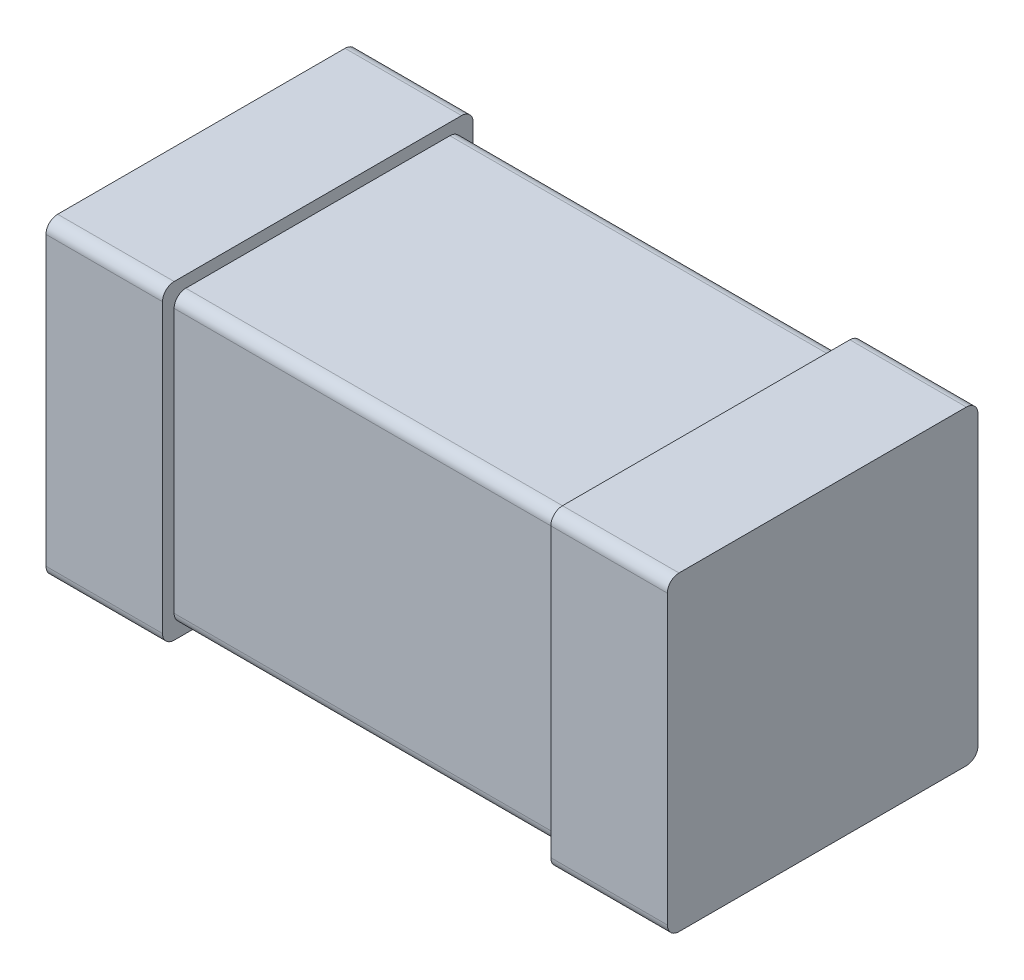
ISO-10303-21;
HEADER;
FILE_DESCRIPTION(('STEP AP214'),'2;1');
FILE_NAME('part.step','',(''),(''),'','','');
FILE_SCHEMA(('AUTOMOTIVE_DESIGN { 1 0 10303 214 1 1 1 1 }'));
ENDSEC;
DATA;
#1=APPLICATION_CONTEXT('core data for automotive mechanical design processes');
#2=APPLICATION_PROTOCOL_DEFINITION('international standard','automotive_design',2000,#1);
#3=PRODUCT_CONTEXT('',#1,'mechanical');
#4=PRODUCT('Part','Part','',(#3));
#5=PRODUCT_RELATED_PRODUCT_CATEGORY('part','',(#4));
#6=PRODUCT_DEFINITION_FORMATION('','',#4);
#7=PRODUCT_DEFINITION_CONTEXT('part definition',#1,'design');
#8=PRODUCT_DEFINITION('design','',#6,#7);
#9=PRODUCT_DEFINITION_SHAPE('','',#8);
#10=(LENGTH_UNIT() NAMED_UNIT(*) SI_UNIT(.MILLI.,.METRE.));
#11=(NAMED_UNIT(*) PLANE_ANGLE_UNIT() SI_UNIT($,.RADIAN.));
#12=(NAMED_UNIT(*) SI_UNIT($,.STERADIAN.) SOLID_ANGLE_UNIT());
#13=UNCERTAINTY_MEASURE_WITH_UNIT(LENGTH_MEASURE(1.E-05),#10,'distance_accuracy_value','');
#14=(GEOMETRIC_REPRESENTATION_CONTEXT(3) GLOBAL_UNCERTAINTY_ASSIGNED_CONTEXT((#13)) GLOBAL_UNIT_ASSIGNED_CONTEXT((#10,
#11,#12)) REPRESENTATION_CONTEXT('',''));
#15=CARTESIAN_POINT('',(0.,0.,0.));
#16=DIRECTION('',(0.,0.,1.));
#17=DIRECTION('',(1.,0.,0.));
#18=AXIS2_PLACEMENT_3D('',#15,#16,#17);
#19=CARTESIAN_POINT('',(0.8,-0.4,0.));
#20=DIRECTION('',(1.,0.,0.));
#21=DIRECTION('',(0.,0.,-1.));
#22=AXIS2_PLACEMENT_3D('',#19,#20,#21);
#23=PLANE('',#22);
#24=DIRECTION('',(0.,1.,0.));
#25=VECTOR('',#24,1.);
#26=CARTESIAN_POINT('',(0.8,-0.4,0.8));
#27=LINE('',#26,#25);
#28=CARTESIAN_POINT('',(0.8,-0.37,0.8));
#29=VERTEX_POINT('',#28);
#30=CARTESIAN_POINT('',(0.8,0.37,0.8));
#31=VERTEX_POINT('',#30);
#32=EDGE_CURVE('E219',#29,#31,#27,.T.);
#33=ORIENTED_EDGE('',*,*,#32,.F.);
#34=CARTESIAN_POINT('',(0.8,-0.37,0.77));
#35=DIRECTION('',(1.,0.,0.));
#36=DIRECTION('',(0.,0.,-1.));
#37=AXIS2_PLACEMENT_3D('',#34,#35,#36);
#38=CIRCLE('',#37,0.03);
#39=CARTESIAN_POINT('',(0.8,-0.4,0.77));
#40=VERTEX_POINT('',#39);
#41=EDGE_CURVE('E291',#40,#29,#38,.F.);
#42=ORIENTED_EDGE('',*,*,#41,.F.);
#43=DIRECTION('',(0.,0.,1.));
#44=VECTOR('',#43,1.);
#45=CARTESIAN_POINT('',(0.8,-0.4,0.));
#46=LINE('',#45,#44);
#47=CARTESIAN_POINT('',(0.8,-0.4,0.03));
#48=VERTEX_POINT('',#47);
#49=EDGE_CURVE('E181',#40,#48,#46,.F.);
#50=ORIENTED_EDGE('',*,*,#49,.T.);
#51=CARTESIAN_POINT('',(0.8,-0.37,0.03));
#52=DIRECTION('',(1.,0.,0.));
#53=DIRECTION('',(0.,0.,-1.));
#54=AXIS2_PLACEMENT_3D('',#51,#52,#53);
#55=CIRCLE('',#54,0.03);
#56=CARTESIAN_POINT('',(0.8,-0.37,0.));
#57=VERTEX_POINT('',#56);
#58=EDGE_CURVE('E20',#57,#48,#55,.F.);
#59=ORIENTED_EDGE('',*,*,#58,.F.);
#60=DIRECTION('',(0.,1.,0.));
#61=VECTOR('',#60,1.);
#62=CARTESIAN_POINT('',(0.8,-0.4,0.));
#63=LINE('',#62,#61);
#64=CARTESIAN_POINT('',(0.8,0.37,0.));
#65=VERTEX_POINT('',#64);
#66=EDGE_CURVE('E178',#57,#65,#63,.T.);
#67=ORIENTED_EDGE('',*,*,#66,.T.);
#68=CARTESIAN_POINT('',(0.8,0.37,0.03));
#69=DIRECTION('',(1.,0.,0.));
#70=DIRECTION('',(0.,0.,-1.));
#71=AXIS2_PLACEMENT_3D('',#68,#69,#70);
#72=CIRCLE('',#71,0.03);
#73=CARTESIAN_POINT('',(0.8,0.4,0.03));
#74=VERTEX_POINT('',#73);
#75=EDGE_CURVE('E192',#74,#65,#72,.F.);
#76=ORIENTED_EDGE('',*,*,#75,.F.);
#77=DIRECTION('',(0.,0.,1.));
#78=VECTOR('',#77,1.);
#79=CARTESIAN_POINT('',(0.8,0.4,0.));
#80=LINE('',#79,#78);
#81=CARTESIAN_POINT('',(0.8,0.4,0.77));
#82=VERTEX_POINT('',#81);
#83=EDGE_CURVE('E223',#82,#74,#80,.F.);
#84=ORIENTED_EDGE('',*,*,#83,.F.);
#85=CARTESIAN_POINT('',(0.8,0.37,0.77));
#86=DIRECTION('',(1.,0.,0.));
#87=DIRECTION('',(0.,0.,-1.));
#88=AXIS2_PLACEMENT_3D('',#85,#86,#87);
#89=CIRCLE('',#88,0.03);
#90=EDGE_CURVE('E294',#31,#82,#89,.F.);
#91=ORIENTED_EDGE('',*,*,#90,.F.);
#92=EDGE_LOOP('',(#33,#42,#50,#59,#67,#76,#84,#91));
#93=FACE_BOUND('',#92,.T.);
#94=ADVANCED_FACE('F17',(#93),#23,.T.);
#95=CARTESIAN_POINT('',(-0.8,-0.4,0.));
#96=DIRECTION('',(1.,0.,0.));
#97=DIRECTION('',(0.,0.,-1.));
#98=AXIS2_PLACEMENT_3D('',#95,#96,#97);
#99=PLANE('',#98);
#100=CARTESIAN_POINT('',(-0.8,-0.37,0.77));
#101=DIRECTION('',(1.,0.,0.));
#102=DIRECTION('',(0.,0.,-1.));
#103=AXIS2_PLACEMENT_3D('',#100,#101,#102);
#104=CIRCLE('',#103,0.03);
#105=CARTESIAN_POINT('',(-0.8,-0.37,0.8));
#106=VERTEX_POINT('',#105);
#107=CARTESIAN_POINT('',(-0.8,-0.4,0.77));
#108=VERTEX_POINT('',#107);
#109=EDGE_CURVE('E281',#106,#108,#104,.T.);
#110=ORIENTED_EDGE('',*,*,#109,.F.);
#111=DIRECTION('',(0.,1.,0.));
#112=VECTOR('',#111,1.);
#113=CARTESIAN_POINT('',(-0.8,-0.4,0.8));
#114=LINE('',#113,#112);
#115=CARTESIAN_POINT('',(-0.8,0.37,0.8));
#116=VERTEX_POINT('',#115);
#117=EDGE_CURVE('E201',#116,#106,#114,.F.);
#118=ORIENTED_EDGE('',*,*,#117,.F.);
#119=CARTESIAN_POINT('',(-0.8,0.37,0.77));
#120=DIRECTION('',(1.,0.,0.));
#121=DIRECTION('',(0.,0.,-1.));
#122=AXIS2_PLACEMENT_3D('',#119,#120,#121);
#123=CIRCLE('',#122,0.03);
#124=CARTESIAN_POINT('',(-0.8,0.4,0.77));
#125=VERTEX_POINT('',#124);
#126=EDGE_CURVE('E210',#125,#116,#123,.T.);
#127=ORIENTED_EDGE('',*,*,#126,.F.);
#128=DIRECTION('',(0.,0.,1.));
#129=VECTOR('',#128,1.);
#130=CARTESIAN_POINT('',(-0.8,0.4,0.));
#131=LINE('',#130,#129);
#132=CARTESIAN_POINT('',(-0.8,0.4,0.03));
#133=VERTEX_POINT('',#132);
#134=EDGE_CURVE('E208',#133,#125,#131,.T.);
#135=ORIENTED_EDGE('',*,*,#134,.F.);
#136=CARTESIAN_POINT('',(-0.8,0.37,0.03));
#137=DIRECTION('',(1.,0.,0.));
#138=DIRECTION('',(0.,0.,-1.));
#139=AXIS2_PLACEMENT_3D('',#136,#137,#138);
#140=CIRCLE('',#139,0.03);
#141=CARTESIAN_POINT('',(-0.8,0.37,0.));
#142=VERTEX_POINT('',#141);
#143=EDGE_CURVE('E287',#142,#133,#140,.T.);
#144=ORIENTED_EDGE('',*,*,#143,.F.);
#145=DIRECTION('',(0.,1.,0.));
#146=VECTOR('',#145,1.);
#147=CARTESIAN_POINT('',(-0.8,-0.4,0.));
#148=LINE('',#147,#146);
#149=CARTESIAN_POINT('',(-0.8,-0.37,0.));
#150=VERTEX_POINT('',#149);
#151=EDGE_CURVE('E212',#142,#150,#148,.F.);
#152=ORIENTED_EDGE('',*,*,#151,.T.);
#153=CARTESIAN_POINT('',(-0.8,-0.37,0.03));
#154=DIRECTION('',(1.,0.,0.));
#155=DIRECTION('',(0.,0.,-1.));
#156=AXIS2_PLACEMENT_3D('',#153,#154,#155);
#157=CIRCLE('',#156,0.03);
#158=CARTESIAN_POINT('',(-0.8,-0.4,0.03));
#159=VERTEX_POINT('',#158);
#160=EDGE_CURVE('E207',#159,#150,#157,.T.);
#161=ORIENTED_EDGE('',*,*,#160,.F.);
#162=DIRECTION('',(0.,0.,1.));
#163=VECTOR('',#162,1.);
#164=CARTESIAN_POINT('',(-0.8,-0.4,0.));
#165=LINE('',#164,#163);
#166=EDGE_CURVE('E205',#159,#108,#165,.T.);
#167=ORIENTED_EDGE('',*,*,#166,.T.);
#168=EDGE_LOOP('',(#110,#118,#127,#135,#144,#152,#161,#167));
#169=FACE_BOUND('',#168,.T.);
#170=ADVANCED_FACE('F689',(#169),#99,.F.);
#171=CARTESIAN_POINT('',(0.5,-0.37,0.03));
#172=DIRECTION('',(1.,0.,0.));
#173=DIRECTION('',(0.,0.,-1.));
#174=AXIS2_PLACEMENT_3D('',#171,#172,#173);
#175=CYLINDRICAL_SURFACE('',#174,0.03);
#176=ORIENTED_EDGE('',*,*,#58,.T.);
#177=DIRECTION('',(1.,0.,0.));
#178=VECTOR('',#177,1.);
#179=CARTESIAN_POINT('',(0.5,-0.4,0.03));
#180=LINE('',#179,#178);
#181=CARTESIAN_POINT('',(0.5,-0.4,0.03));
#182=VERTEX_POINT('',#181);
#183=EDGE_CURVE('E336',#48,#182,#180,.F.);
#184=ORIENTED_EDGE('',*,*,#183,.T.);
#185=CARTESIAN_POINT('',(0.5,-0.37,0.03));
#186=DIRECTION('',(1.,0.,0.));
#187=DIRECTION('',(0.,0.,-1.));
#188=AXIS2_PLACEMENT_3D('',#185,#186,#187);
#189=CIRCLE('',#188,0.03);
#190=CARTESIAN_POINT('',(0.5,-0.37,0.));
#191=VERTEX_POINT('',#190);
#192=EDGE_CURVE('E196',#182,#191,#189,.T.);
#193=ORIENTED_EDGE('',*,*,#192,.T.);
#194=DIRECTION('',(1.,0.,0.));
#195=VECTOR('',#194,1.);
#196=CARTESIAN_POINT('',(0.5,-0.37,0.));
#197=LINE('',#196,#195);
#198=EDGE_CURVE('E186',#191,#57,#197,.T.);
#199=ORIENTED_EDGE('',*,*,#198,.T.);
#200=EDGE_LOOP('',(#176,#184,#193,#199));
#201=FACE_BOUND('',#200,.T.);
#202=ADVANCED_FACE('F195',(#201),#175,.T.);
#203=CARTESIAN_POINT('',(0.5,-0.4,0.));
#204=DIRECTION('',(0.,0.,1.));
#205=DIRECTION('',(1.,0.,0.));
#206=AXIS2_PLACEMENT_3D('',#203,#204,#205);
#207=PLANE('',#206);
#208=DIRECTION('',(1.,0.,0.));
#209=VECTOR('',#208,1.);
#210=CARTESIAN_POINT('',(0.5,0.37,0.));
#211=LINE('',#210,#209);
#212=CARTESIAN_POINT('',(0.5,0.37,0.));
#213=VERTEX_POINT('',#212);
#214=EDGE_CURVE('E191',#65,#213,#211,.F.);
#215=ORIENTED_EDGE('',*,*,#214,.F.);
#216=ORIENTED_EDGE('',*,*,#66,.F.);
#217=ORIENTED_EDGE('',*,*,#198,.F.);
#218=DIRECTION('',(0.,1.,0.));
#219=VECTOR('',#218,1.);
#220=CARTESIAN_POINT('',(0.5,-0.4,0.));
#221=LINE('',#220,#219);
#222=EDGE_CURVE('E278',#191,#213,#221,.T.);
#223=ORIENTED_EDGE('',*,*,#222,.T.);
#224=EDGE_LOOP('',(#215,#216,#217,#223));
#225=FACE_BOUND('',#224,.T.);
#226=ADVANCED_FACE('F188',(#225),#207,.F.);
#227=CARTESIAN_POINT('',(0.5,0.37,0.03));
#228=DIRECTION('',(1.,0.,0.));
#229=DIRECTION('',(0.,0.,-1.));
#230=AXIS2_PLACEMENT_3D('',#227,#228,#229);
#231=CYLINDRICAL_SURFACE('',#230,0.03);
#232=ORIENTED_EDGE('',*,*,#214,.T.);
#233=CARTESIAN_POINT('',(0.5,0.37,0.03));
#234=DIRECTION('',(1.,0.,0.));
#235=DIRECTION('',(0.,0.,-1.));
#236=AXIS2_PLACEMENT_3D('',#233,#234,#235);
#237=CIRCLE('',#236,0.03);
#238=CARTESIAN_POINT('',(0.5,0.4,0.03));
#239=VERTEX_POINT('',#238);
#240=EDGE_CURVE('E275',#213,#239,#237,.T.);
#241=ORIENTED_EDGE('',*,*,#240,.T.);
#242=DIRECTION('',(1.,0.,0.));
#243=VECTOR('',#242,1.);
#244=CARTESIAN_POINT('',(0.5,0.4,0.03));
#245=LINE('',#244,#243);
#246=EDGE_CURVE('E224',#74,#239,#245,.F.);
#247=ORIENTED_EDGE('',*,*,#246,.F.);
#248=ORIENTED_EDGE('',*,*,#75,.T.);
#249=EDGE_LOOP('',(#232,#241,#247,#248));
#250=FACE_BOUND('',#249,.T.);
#251=ADVANCED_FACE('F298',(#250),#231,.T.);
#252=CARTESIAN_POINT('',(0.5,0.4,0.));
#253=DIRECTION('',(0.,1.,0.));
#254=DIRECTION('',(0.,0.,1.));
#255=AXIS2_PLACEMENT_3D('',#252,#253,#254);
#256=PLANE('',#255);
#257=DIRECTION('',(0.,0.,-1.));
#258=VECTOR('',#257,1.);
#259=CARTESIAN_POINT('',(0.5,0.4,0.));
#260=LINE('',#259,#258);
#261=CARTESIAN_POINT('',(0.5,0.4,0.77));
#262=VERTEX_POINT('',#261);
#263=EDGE_CURVE('E274',#239,#262,#260,.F.);
#264=ORIENTED_EDGE('',*,*,#263,.T.);
#265=DIRECTION('',(1.,0.,0.));
#266=VECTOR('',#265,1.);
#267=CARTESIAN_POINT('',(0.5,0.4,0.77));
#268=LINE('',#267,#266);
#269=EDGE_CURVE('E222',#82,#262,#268,.F.);
#270=ORIENTED_EDGE('',*,*,#269,.F.);
#271=ORIENTED_EDGE('',*,*,#83,.T.);
#272=ORIENTED_EDGE('',*,*,#246,.T.);
#273=EDGE_LOOP('',(#264,#270,#271,#272));
#274=FACE_BOUND('',#273,.T.);
#275=ADVANCED_FACE('F341',(#274),#256,.T.);
#276=CARTESIAN_POINT('',(0.5,0.37,0.77));
#277=DIRECTION('',(1.,0.,0.));
#278=DIRECTION('',(0.,0.,-1.));
#279=AXIS2_PLACEMENT_3D('',#276,#277,#278);
#280=CYLINDRICAL_SURFACE('',#279,0.03);
#281=ORIENTED_EDGE('',*,*,#90,.T.);
#282=ORIENTED_EDGE('',*,*,#269,.T.);
#283=CARTESIAN_POINT('',(0.5,0.37,0.77));
#284=DIRECTION('',(1.,0.,0.));
#285=DIRECTION('',(0.,0.,-1.));
#286=AXIS2_PLACEMENT_3D('',#283,#284,#285);
#287=CIRCLE('',#286,0.03);
#288=CARTESIAN_POINT('',(0.5,0.37,0.8));
#289=VERTEX_POINT('',#288);
#290=EDGE_CURVE('E271',#262,#289,#287,.T.);
#291=ORIENTED_EDGE('',*,*,#290,.T.);
#292=DIRECTION('',(1.,0.,0.));
#293=VECTOR('',#292,1.);
#294=CARTESIAN_POINT('',(0.5,0.37,0.8));
#295=LINE('',#294,#293);
#296=EDGE_CURVE('E221',#31,#289,#295,.F.);
#297=ORIENTED_EDGE('',*,*,#296,.F.);
#298=EDGE_LOOP('',(#281,#282,#291,#297));
#299=FACE_BOUND('',#298,.T.);
#300=ADVANCED_FACE('F348',(#299),#280,.T.);
#301=CARTESIAN_POINT('',(0.5,-0.4,0.8));
#302=DIRECTION('',(0.,0.,1.));
#303=DIRECTION('',(1.,0.,0.));
#304=AXIS2_PLACEMENT_3D('',#301,#302,#303);
#305=PLANE('',#304);
#306=ORIENTED_EDGE('',*,*,#32,.T.);
#307=ORIENTED_EDGE('',*,*,#296,.T.);
#308=DIRECTION('',(0.,1.,0.));
#309=VECTOR('',#308,1.);
#310=CARTESIAN_POINT('',(0.5,-0.4,0.8));
#311=LINE('',#310,#309);
#312=CARTESIAN_POINT('',(0.5,-0.37,0.8));
#313=VERTEX_POINT('',#312);
#314=EDGE_CURVE('E270',#289,#313,#311,.F.);
#315=ORIENTED_EDGE('',*,*,#314,.T.);
#316=DIRECTION('',(1.,0.,0.));
#317=VECTOR('',#316,1.);
#318=CARTESIAN_POINT('',(0.5,-0.37,0.8));
#319=LINE('',#318,#317);
#320=EDGE_CURVE('E293',#29,#313,#319,.F.);
#321=ORIENTED_EDGE('',*,*,#320,.F.);
#322=EDGE_LOOP('',(#306,#307,#315,#321));
#323=FACE_BOUND('',#322,.T.);
#324=ADVANCED_FACE('F352',(#323),#305,.T.);
#325=CARTESIAN_POINT('',(0.5,-0.37,0.77));
#326=DIRECTION('',(1.,0.,0.));
#327=DIRECTION('',(0.,0.,-1.));
#328=AXIS2_PLACEMENT_3D('',#325,#326,#327);
#329=CYLINDRICAL_SURFACE('',#328,0.03);
#330=ORIENTED_EDGE('',*,*,#320,.T.);
#331=CARTESIAN_POINT('',(0.5,-0.37,0.77));
#332=DIRECTION('',(1.,0.,0.));
#333=DIRECTION('',(0.,0.,-1.));
#334=AXIS2_PLACEMENT_3D('',#331,#332,#333);
#335=CIRCLE('',#334,0.03);
#336=CARTESIAN_POINT('',(0.5,-0.4,0.77));
#337=VERTEX_POINT('',#336);
#338=EDGE_CURVE('E266',#313,#337,#335,.T.);
#339=ORIENTED_EDGE('',*,*,#338,.T.);
#340=DIRECTION('',(1.,0.,0.));
#341=VECTOR('',#340,1.);
#342=CARTESIAN_POINT('',(0.5,-0.4,0.77));
#343=LINE('',#342,#341);
#344=EDGE_CURVE('E218',#337,#40,#343,.T.);
#345=ORIENTED_EDGE('',*,*,#344,.T.);
#346=ORIENTED_EDGE('',*,*,#41,.T.);
#347=EDGE_LOOP('',(#330,#339,#345,#346));
#348=FACE_BOUND('',#347,.T.);
#349=ADVANCED_FACE('F630',(#348),#329,.T.);
#350=CARTESIAN_POINT('',(0.5,-0.4,0.));
#351=DIRECTION('',(0.,1.,0.));
#352=DIRECTION('',(0.,0.,1.));
#353=AXIS2_PLACEMENT_3D('',#350,#351,#352);
#354=PLANE('',#353);
#355=ORIENTED_EDGE('',*,*,#344,.F.);
#356=DIRECTION('',(0.,0.,-1.));
#357=VECTOR('',#356,1.);
#358=CARTESIAN_POINT('',(0.5,-0.4,0.));
#359=LINE('',#358,#357);
#360=EDGE_CURVE('E269',#337,#182,#359,.T.);
#361=ORIENTED_EDGE('',*,*,#360,.T.);
#362=ORIENTED_EDGE('',*,*,#183,.F.);
#363=ORIENTED_EDGE('',*,*,#49,.F.);
#364=EDGE_LOOP('',(#355,#361,#362,#363));
#365=FACE_BOUND('',#364,.T.);
#366=ADVANCED_FACE('F620',(#365),#354,.F.);
#367=CARTESIAN_POINT('',(-0.8,-0.4,0.));
#368=DIRECTION('',(0.,1.,0.));
#369=DIRECTION('',(0.,0.,1.));
#370=AXIS2_PLACEMENT_3D('',#367,#368,#369);
#371=PLANE('',#370);
#372=DIRECTION('',(1.,0.,0.));
#373=VECTOR('',#372,1.);
#374=CARTESIAN_POINT('',(-0.8,-0.4,0.77));
#375=LINE('',#374,#373);
#376=CARTESIAN_POINT('',(-0.5,-0.4,0.77));
#377=VERTEX_POINT('',#376);
#378=EDGE_CURVE('E318',#108,#377,#375,.T.);
#379=ORIENTED_EDGE('',*,*,#378,.F.);
#380=ORIENTED_EDGE('',*,*,#166,.F.);
#381=DIRECTION('',(1.,0.,0.));
#382=VECTOR('',#381,1.);
#383=CARTESIAN_POINT('',(-0.8,-0.4,0.03));
#384=LINE('',#383,#382);
#385=CARTESIAN_POINT('',(-0.5,-0.4,0.03));
#386=VERTEX_POINT('',#385);
#387=EDGE_CURVE('E290',#386,#159,#384,.F.);
#388=ORIENTED_EDGE('',*,*,#387,.F.);
#389=DIRECTION('',(0.,0.,-1.));
#390=VECTOR('',#389,1.);
#391=CARTESIAN_POINT('',(-0.5,-0.4,0.));
#392=LINE('',#391,#390);
#393=EDGE_CURVE('E250',#377,#386,#392,.T.);
#394=ORIENTED_EDGE('',*,*,#393,.F.);
#395=EDGE_LOOP('',(#379,#380,#388,#394));
#396=FACE_BOUND('',#395,.T.);
#397=ADVANCED_FACE('F610',(#396),#371,.F.);
#398=CARTESIAN_POINT('',(-0.8,-0.37,0.03));
#399=DIRECTION('',(1.,0.,0.));
#400=DIRECTION('',(0.,0.,-1.));
#401=AXIS2_PLACEMENT_3D('',#398,#399,#400);
#402=CYLINDRICAL_SURFACE('',#401,0.03);
#403=CARTESIAN_POINT('',(-0.5,-0.37,0.03));
#404=DIRECTION('',(1.,0.,0.));
#405=DIRECTION('',(0.,0.,-1.));
#406=AXIS2_PLACEMENT_3D('',#403,#404,#405);
#407=CIRCLE('',#406,0.03);
#408=CARTESIAN_POINT('',(-0.5,-0.37,0.));
#409=VERTEX_POINT('',#408);
#410=EDGE_CURVE('E248',#386,#409,#407,.T.);
#411=ORIENTED_EDGE('',*,*,#410,.F.);
#412=ORIENTED_EDGE('',*,*,#387,.T.);
#413=ORIENTED_EDGE('',*,*,#160,.T.);
#414=DIRECTION('',(1.,0.,0.));
#415=VECTOR('',#414,1.);
#416=CARTESIAN_POINT('',(-0.8,-0.37,0.));
#417=LINE('',#416,#415);
#418=EDGE_CURVE('E216',#150,#409,#417,.T.);
#419=ORIENTED_EDGE('',*,*,#418,.T.);
#420=EDGE_LOOP('',(#411,#412,#413,#419));
#421=FACE_BOUND('',#420,.T.);
#422=ADVANCED_FACE('F600',(#421),#402,.T.);
#423=CARTESIAN_POINT('',(-0.8,-0.4,0.));
#424=DIRECTION('',(0.,0.,1.));
#425=DIRECTION('',(1.,0.,0.));
#426=AXIS2_PLACEMENT_3D('',#423,#424,#425);
#427=PLANE('',#426);
#428=DIRECTION('',(1.,0.,0.));
#429=VECTOR('',#428,1.);
#430=CARTESIAN_POINT('',(-0.8,0.37,0.));
#431=LINE('',#430,#429);
#432=CARTESIAN_POINT('',(-0.5,0.37,0.));
#433=VERTEX_POINT('',#432);
#434=EDGE_CURVE('E215',#433,#142,#431,.F.);
#435=ORIENTED_EDGE('',*,*,#434,.F.);
#436=DIRECTION('',(0.,1.,0.));
#437=VECTOR('',#436,1.);
#438=CARTESIAN_POINT('',(-0.5,-0.4,0.));
#439=LINE('',#438,#437);
#440=EDGE_CURVE('E247',#409,#433,#439,.T.);
#441=ORIENTED_EDGE('',*,*,#440,.F.);
#442=ORIENTED_EDGE('',*,*,#418,.F.);
#443=ORIENTED_EDGE('',*,*,#151,.F.);
#444=EDGE_LOOP('',(#435,#441,#442,#443));
#445=FACE_BOUND('',#444,.T.);
#446=ADVANCED_FACE('F590',(#445),#427,.F.);
#447=CARTESIAN_POINT('',(-0.8,0.37,0.03));
#448=DIRECTION('',(1.,0.,0.));
#449=DIRECTION('',(0.,0.,-1.));
#450=AXIS2_PLACEMENT_3D('',#447,#448,#449);
#451=CYLINDRICAL_SURFACE('',#450,0.03);
#452=ORIENTED_EDGE('',*,*,#434,.T.);
#453=ORIENTED_EDGE('',*,*,#143,.T.);
#454=DIRECTION('',(1.,0.,0.));
#455=VECTOR('',#454,1.);
#456=CARTESIAN_POINT('',(-0.8,0.4,0.03));
#457=LINE('',#456,#455);
#458=CARTESIAN_POINT('',(-0.5,0.4,0.03));
#459=VERTEX_POINT('',#458);
#460=EDGE_CURVE('E211',#459,#133,#457,.F.);
#461=ORIENTED_EDGE('',*,*,#460,.F.);
#462=CARTESIAN_POINT('',(-0.5,0.37,0.03));
#463=DIRECTION('',(1.,0.,0.));
#464=DIRECTION('',(0.,0.,-1.));
#465=AXIS2_PLACEMENT_3D('',#462,#463,#464);
#466=CIRCLE('',#465,0.03);
#467=EDGE_CURVE('E245',#433,#459,#466,.T.);
#468=ORIENTED_EDGE('',*,*,#467,.F.);
#469=EDGE_LOOP('',(#452,#453,#461,#468));
#470=FACE_BOUND('',#469,.T.);
#471=ADVANCED_FACE('F580',(#470),#451,.T.);
#472=CARTESIAN_POINT('',(-0.8,0.4,0.));
#473=DIRECTION('',(0.,1.,0.));
#474=DIRECTION('',(0.,0.,1.));
#475=AXIS2_PLACEMENT_3D('',#472,#473,#474);
#476=PLANE('',#475);
#477=ORIENTED_EDGE('',*,*,#134,.T.);
#478=DIRECTION('',(1.,0.,0.));
#479=VECTOR('',#478,1.);
#480=CARTESIAN_POINT('',(-0.8,0.4,0.77));
#481=LINE('',#480,#479);
#482=CARTESIAN_POINT('',(-0.5,0.4,0.77));
#483=VERTEX_POINT('',#482);
#484=EDGE_CURVE('E204',#483,#125,#481,.F.);
#485=ORIENTED_EDGE('',*,*,#484,.F.);
#486=DIRECTION('',(0.,0.,-1.));
#487=VECTOR('',#486,1.);
#488=CARTESIAN_POINT('',(-0.5,0.4,0.));
#489=LINE('',#488,#487);
#490=EDGE_CURVE('E244',#459,#483,#489,.F.);
#491=ORIENTED_EDGE('',*,*,#490,.F.);
#492=ORIENTED_EDGE('',*,*,#460,.T.);
#493=EDGE_LOOP('',(#477,#485,#491,#492));
#494=FACE_BOUND('',#493,.T.);
#495=ADVANCED_FACE('F570',(#494),#476,.T.);
#496=CARTESIAN_POINT('',(-0.8,0.37,0.77));
#497=DIRECTION('',(1.,0.,0.));
#498=DIRECTION('',(0.,0.,-1.));
#499=AXIS2_PLACEMENT_3D('',#496,#497,#498);
#500=CYLINDRICAL_SURFACE('',#499,0.03);
#501=CARTESIAN_POINT('',(-0.5,0.37,0.77));
#502=DIRECTION('',(1.,0.,0.));
#503=DIRECTION('',(0.,0.,-1.));
#504=AXIS2_PLACEMENT_3D('',#501,#502,#503);
#505=CIRCLE('',#504,0.03);
#506=CARTESIAN_POINT('',(-0.5,0.37,0.8));
#507=VERTEX_POINT('',#506);
#508=EDGE_CURVE('E242',#483,#507,#505,.T.);
#509=ORIENTED_EDGE('',*,*,#508,.F.);
#510=ORIENTED_EDGE('',*,*,#484,.T.);
#511=ORIENTED_EDGE('',*,*,#126,.T.);
#512=DIRECTION('',(1.,0.,0.));
#513=VECTOR('',#512,1.);
#514=CARTESIAN_POINT('',(-0.8,0.37,0.8));
#515=LINE('',#514,#513);
#516=EDGE_CURVE('E203',#507,#116,#515,.F.);
#517=ORIENTED_EDGE('',*,*,#516,.F.);
#518=EDGE_LOOP('',(#509,#510,#511,#517));
#519=FACE_BOUND('',#518,.T.);
#520=ADVANCED_FACE('F560',(#519),#500,.T.);
#521=CARTESIAN_POINT('',(-0.8,-0.4,0.8));
#522=DIRECTION('',(0.,0.,1.));
#523=DIRECTION('',(1.,0.,0.));
#524=AXIS2_PLACEMENT_3D('',#521,#522,#523);
#525=PLANE('',#524);
#526=DIRECTION('',(0.,1.,0.));
#527=VECTOR('',#526,1.);
#528=CARTESIAN_POINT('',(-0.5,-0.4,0.8));
#529=LINE('',#528,#527);
#530=CARTESIAN_POINT('',(-0.5,-0.37,0.8));
#531=VERTEX_POINT('',#530);
#532=EDGE_CURVE('E241',#507,#531,#529,.F.);
#533=ORIENTED_EDGE('',*,*,#532,.F.);
#534=ORIENTED_EDGE('',*,*,#516,.T.);
#535=ORIENTED_EDGE('',*,*,#117,.T.);
#536=DIRECTION('',(1.,0.,0.));
#537=VECTOR('',#536,1.);
#538=CARTESIAN_POINT('',(-0.8,-0.37,0.8));
#539=LINE('',#538,#537);
#540=EDGE_CURVE('E285',#531,#106,#539,.F.);
#541=ORIENTED_EDGE('',*,*,#540,.F.);
#542=EDGE_LOOP('',(#533,#534,#535,#541));
#543=FACE_BOUND('',#542,.T.);
#544=ADVANCED_FACE('F550',(#543),#525,.T.);
#545=CARTESIAN_POINT('',(-0.8,-0.37,0.77));
#546=DIRECTION('',(1.,0.,0.));
#547=DIRECTION('',(0.,0.,-1.));
#548=AXIS2_PLACEMENT_3D('',#545,#546,#547);
#549=CYLINDRICAL_SURFACE('',#548,0.03);
#550=ORIENTED_EDGE('',*,*,#540,.T.);
#551=ORIENTED_EDGE('',*,*,#109,.T.);
#552=ORIENTED_EDGE('',*,*,#378,.T.);
#553=CARTESIAN_POINT('',(-0.5,-0.37,0.77));
#554=DIRECTION('',(1.,0.,0.));
#555=DIRECTION('',(0.,0.,-1.));
#556=AXIS2_PLACEMENT_3D('',#553,#554,#555);
#557=CIRCLE('',#556,0.03);
#558=EDGE_CURVE('E238',#531,#377,#557,.T.);
#559=ORIENTED_EDGE('',*,*,#558,.F.);
#560=EDGE_LOOP('',(#550,#551,#552,#559));
#561=FACE_BOUND('',#560,.T.);
#562=ADVANCED_FACE('F510',(#561),#549,.T.);
#563=CARTESIAN_POINT('',(-0.5,-0.37,0.03));
#564=DIRECTION('',(0.,1.,0.));
#565=DIRECTION('',(0.,0.,1.));
#566=AXIS2_PLACEMENT_3D('',#563,#564,#565);
#567=PLANE('',#566);
#568=DIRECTION('',(1.,0.,0.));
#569=VECTOR('',#568,1.);
#570=CARTESIAN_POINT('',(-0.5,-0.37,0.74));
#571=LINE('',#570,#569);
#572=CARTESIAN_POINT('',(-0.5,-0.37,0.74));
#573=VERTEX_POINT('',#572);
#574=CARTESIAN_POINT('',(0.5,-0.37,0.74));
#575=VERTEX_POINT('',#574);
#576=EDGE_CURVE('E284',#573,#575,#571,.T.);
#577=ORIENTED_EDGE('',*,*,#576,.F.);
#578=DIRECTION('',(0.,0.,-1.));
#579=VECTOR('',#578,1.);
#580=CARTESIAN_POINT('',(-0.5,-0.37,0.));
#581=LINE('',#580,#579);
#582=CARTESIAN_POINT('',(-0.5,-0.37,0.06));
#583=VERTEX_POINT('',#582);
#584=EDGE_CURVE('E234',#583,#573,#581,.F.);
#585=ORIENTED_EDGE('',*,*,#584,.F.);
#586=DIRECTION('',(1.,0.,0.));
#587=VECTOR('',#586,1.);
#588=CARTESIAN_POINT('',(-0.5,-0.37,0.06));
#589=LINE('',#588,#587);
#590=CARTESIAN_POINT('',(0.5,-0.37,0.06));
#591=VERTEX_POINT('',#590);
#592=EDGE_CURVE('E280',#591,#583,#589,.F.);
#593=ORIENTED_EDGE('',*,*,#592,.F.);
#594=DIRECTION('',(0.,0.,-1.));
#595=VECTOR('',#594,1.);
#596=CARTESIAN_POINT('',(0.5,-0.37,0.));
#597=LINE('',#596,#595);
#598=EDGE_CURVE('E265',#591,#575,#597,.F.);
#599=ORIENTED_EDGE('',*,*,#598,.T.);
#600=EDGE_LOOP('',(#577,#585,#593,#599));
#601=FACE_BOUND('',#600,.T.);
#602=ADVANCED_FACE('F401',(#601),#567,.F.);
#603=CARTESIAN_POINT('',(-0.5,-0.34,0.74));
#604=DIRECTION('',(1.,0.,0.));
#605=DIRECTION('',(0.,0.,-1.));
#606=AXIS2_PLACEMENT_3D('',#603,#604,#605);
#607=CYLINDRICAL_SURFACE('',#606,0.03);
#608=DIRECTION('',(1.,0.,0.));
#609=VECTOR('',#608,1.);
#610=CARTESIAN_POINT('',(-0.5,-0.34,0.77));
#611=LINE('',#610,#609);
#612=CARTESIAN_POINT('',(-0.5,-0.34,0.77));
#613=VERTEX_POINT('',#612);
#614=CARTESIAN_POINT('',(0.5,-0.34,0.77));
#615=VERTEX_POINT('',#614);
#616=EDGE_CURVE('E314',#613,#615,#611,.T.);
#617=ORIENTED_EDGE('',*,*,#616,.F.);
#618=CARTESIAN_POINT('',(-0.5,-0.34,0.74));
#619=DIRECTION('',(1.,0.,0.));
#620=DIRECTION('',(0.,0.,-1.));
#621=AXIS2_PLACEMENT_3D('',#618,#619,#620);
#622=CIRCLE('',#621,0.03);
#623=EDGE_CURVE('E232',#573,#613,#622,.F.);
#624=ORIENTED_EDGE('',*,*,#623,.F.);
#625=ORIENTED_EDGE('',*,*,#576,.T.);
#626=CARTESIAN_POINT('',(0.5,-0.34,0.74));
#627=DIRECTION('',(1.,0.,0.));
#628=DIRECTION('',(0.,0.,-1.));
#629=AXIS2_PLACEMENT_3D('',#626,#627,#628);
#630=CIRCLE('',#629,0.03);
#631=EDGE_CURVE('E262',#575,#615,#630,.F.);
#632=ORIENTED_EDGE('',*,*,#631,.T.);
#633=EDGE_LOOP('',(#617,#624,#625,#632));
#634=FACE_BOUND('',#633,.T.);
#635=ADVANCED_FACE('F405',(#634),#607,.T.);
#636=CARTESIAN_POINT('',(-0.5,-0.37,0.77));
#637=DIRECTION('',(0.,0.,1.));
#638=DIRECTION('',(1.,0.,0.));
#639=AXIS2_PLACEMENT_3D('',#636,#637,#638);
#640=PLANE('',#639);
#641=DIRECTION('',(0.,1.,0.));
#642=VECTOR('',#641,1.);
#643=CARTESIAN_POINT('',(0.5,-0.4,0.77));
#644=LINE('',#643,#642);
#645=CARTESIAN_POINT('',(0.5,0.34,0.77));
#646=VERTEX_POINT('',#645);
#647=EDGE_CURVE('E261',#615,#646,#644,.T.);
#648=ORIENTED_EDGE('',*,*,#647,.T.);
#649=DIRECTION('',(1.,0.,0.));
#650=VECTOR('',#649,1.);
#651=CARTESIAN_POINT('',(-0.5,0.34,0.77));
#652=LINE('',#651,#650);
#653=CARTESIAN_POINT('',(-0.5,0.34,0.77));
#654=VERTEX_POINT('',#653);
#655=EDGE_CURVE('E312',#654,#646,#652,.T.);
#656=ORIENTED_EDGE('',*,*,#655,.F.);
#657=DIRECTION('',(0.,1.,0.));
#658=VECTOR('',#657,1.);
#659=CARTESIAN_POINT('',(-0.5,-0.4,0.77));
#660=LINE('',#659,#658);
#661=EDGE_CURVE('E231',#613,#654,#660,.T.);
#662=ORIENTED_EDGE('',*,*,#661,.F.);
#663=ORIENTED_EDGE('',*,*,#616,.T.);
#664=EDGE_LOOP('',(#648,#656,#662,#663));
#665=FACE_BOUND('',#664,.T.);
#666=ADVANCED_FACE('F409',(#665),#640,.T.);
#667=CARTESIAN_POINT('',(-0.5,0.34,0.74));
#668=DIRECTION('',(1.,0.,0.));
#669=DIRECTION('',(0.,0.,-1.));
#670=AXIS2_PLACEMENT_3D('',#667,#668,#669);
#671=CYLINDRICAL_SURFACE('',#670,0.03);
#672=CARTESIAN_POINT('',(0.5,0.34,0.74));
#673=DIRECTION('',(1.,0.,0.));
#674=DIRECTION('',(0.,0.,-1.));
#675=AXIS2_PLACEMENT_3D('',#672,#673,#674);
#676=CIRCLE('',#675,0.03);
#677=CARTESIAN_POINT('',(0.5,0.37,0.74));
#678=VERTEX_POINT('',#677);
#679=EDGE_CURVE('E258',#646,#678,#676,.F.);
#680=ORIENTED_EDGE('',*,*,#679,.T.);
#681=DIRECTION('',(1.,0.,0.));
#682=VECTOR('',#681,1.);
#683=CARTESIAN_POINT('',(-0.5,0.37,0.74));
#684=LINE('',#683,#682);
#685=CARTESIAN_POINT('',(-0.5,0.37,0.74));
#686=VERTEX_POINT('',#685);
#687=EDGE_CURVE('E310',#686,#678,#684,.T.);
#688=ORIENTED_EDGE('',*,*,#687,.F.);
#689=CARTESIAN_POINT('',(-0.5,0.34,0.74));
#690=DIRECTION('',(1.,0.,0.));
#691=DIRECTION('',(0.,0.,-1.));
#692=AXIS2_PLACEMENT_3D('',#689,#690,#691);
#693=CIRCLE('',#692,0.03);
#694=EDGE_CURVE('E229',#654,#686,#693,.F.);
#695=ORIENTED_EDGE('',*,*,#694,.F.);
#696=ORIENTED_EDGE('',*,*,#655,.T.);
#697=EDGE_LOOP('',(#680,#688,#695,#696));
#698=FACE_BOUND('',#697,.T.);
#699=ADVANCED_FACE('F413',(#698),#671,.T.);
#700=CARTESIAN_POINT('',(-0.5,0.37,0.03));
#701=DIRECTION('',(0.,1.,0.));
#702=DIRECTION('',(0.,0.,1.));
#703=AXIS2_PLACEMENT_3D('',#700,#701,#702);
#704=PLANE('',#703);
#705=DIRECTION('',(0.,0.,-1.));
#706=VECTOR('',#705,1.);
#707=CARTESIAN_POINT('',(-0.5,0.37,0.));
#708=LINE('',#707,#706);
#709=CARTESIAN_POINT('',(-0.5,0.37,0.06));
#710=VERTEX_POINT('',#709);
#711=EDGE_CURVE('E228',#686,#710,#708,.T.);
#712=ORIENTED_EDGE('',*,*,#711,.F.);
#713=ORIENTED_EDGE('',*,*,#687,.T.);
#714=DIRECTION('',(0.,0.,-1.));
#715=VECTOR('',#714,1.);
#716=CARTESIAN_POINT('',(0.5,0.37,0.));
#717=LINE('',#716,#715);
#718=CARTESIAN_POINT('',(0.5,0.37,0.06));
#719=VERTEX_POINT('',#718);
#720=EDGE_CURVE('E257',#678,#719,#717,.T.);
#721=ORIENTED_EDGE('',*,*,#720,.T.);
#722=DIRECTION('',(1.,0.,0.));
#723=VECTOR('',#722,1.);
#724=CARTESIAN_POINT('',(-0.5,0.37,0.06));
#725=LINE('',#724,#723);
#726=EDGE_CURVE('E253',#710,#719,#725,.T.);
#727=ORIENTED_EDGE('',*,*,#726,.F.);
#728=EDGE_LOOP('',(#712,#713,#721,#727));
#729=FACE_BOUND('',#728,.T.);
#730=ADVANCED_FACE('F383',(#729),#704,.T.);
#731=CARTESIAN_POINT('',(-0.5,-0.34,0.06));
#732=DIRECTION('',(1.,0.,0.));
#733=DIRECTION('',(0.,0.,-1.));
#734=AXIS2_PLACEMENT_3D('',#731,#732,#733);
#735=CYLINDRICAL_SURFACE('',#734,0.03);
#736=CARTESIAN_POINT('',(0.5,-0.34,0.06));
#737=DIRECTION('',(1.,0.,0.));
#738=DIRECTION('',(0.,0.,-1.));
#739=AXIS2_PLACEMENT_3D('',#736,#737,#738);
#740=CIRCLE('',#739,0.03);
#741=CARTESIAN_POINT('',(0.5,-0.34,0.03));
#742=VERTEX_POINT('',#741);
#743=EDGE_CURVE('E254',#742,#591,#740,.F.);
#744=ORIENTED_EDGE('',*,*,#743,.T.);
#745=ORIENTED_EDGE('',*,*,#592,.T.);
#746=CARTESIAN_POINT('',(-0.5,-0.34,0.06));
#747=DIRECTION('',(1.,0.,0.));
#748=DIRECTION('',(0.,0.,-1.));
#749=AXIS2_PLACEMENT_3D('',#746,#747,#748);
#750=CIRCLE('',#749,0.03);
#751=CARTESIAN_POINT('',(-0.5,-0.34,0.03));
#752=VERTEX_POINT('',#751);
#753=EDGE_CURVE('E235',#752,#583,#750,.F.);
#754=ORIENTED_EDGE('',*,*,#753,.F.);
#755=DIRECTION('',(1.,0.,0.));
#756=VECTOR('',#755,1.);
#757=CARTESIAN_POINT('',(-0.5,-0.34,0.03));
#758=LINE('',#757,#756);
#759=EDGE_CURVE('E227',#752,#742,#758,.T.);
#760=ORIENTED_EDGE('',*,*,#759,.T.);
#761=EDGE_LOOP('',(#744,#745,#754,#760));
#762=FACE_BOUND('',#761,.T.);
#763=ADVANCED_FACE('F396',(#762),#735,.T.);
#764=CARTESIAN_POINT('',(0.5,-0.4,0.));
#765=DIRECTION('',(1.,0.,0.));
#766=DIRECTION('',(0.,0.,-1.));
#767=AXIS2_PLACEMENT_3D('',#764,#765,#766);
#768=PLANE('',#767);
#769=DIRECTION('',(0.,1.,0.));
#770=VECTOR('',#769,1.);
#771=CARTESIAN_POINT('',(0.5,-0.37,0.03));
#772=LINE('',#771,#770);
#773=CARTESIAN_POINT('',(0.5,0.34,0.03));
#774=VERTEX_POINT('',#773);
#775=EDGE_CURVE('E363',#742,#774,#772,.T.);
#776=ORIENTED_EDGE('',*,*,#775,.T.);
#777=CARTESIAN_POINT('',(0.5,0.34,0.06));
#778=DIRECTION('',(1.,0.,0.));
#779=DIRECTION('',(0.,0.,-1.));
#780=AXIS2_PLACEMENT_3D('',#777,#778,#779);
#781=CIRCLE('',#780,0.03);
#782=EDGE_CURVE('E251',#719,#774,#781,.F.);
#783=ORIENTED_EDGE('',*,*,#782,.F.);
#784=ORIENTED_EDGE('',*,*,#720,.F.);
#785=ORIENTED_EDGE('',*,*,#679,.F.);
#786=ORIENTED_EDGE('',*,*,#647,.F.);
#787=ORIENTED_EDGE('',*,*,#631,.F.);
#788=ORIENTED_EDGE('',*,*,#598,.F.);
#789=ORIENTED_EDGE('',*,*,#743,.F.);
#790=EDGE_LOOP('',(#776,#783,#784,#785,#786,#787,#788,#789));
#791=FACE_BOUND('',#790,.T.);
#792=ORIENTED_EDGE('',*,*,#338,.F.);
#793=ORIENTED_EDGE('',*,*,#314,.F.);
#794=ORIENTED_EDGE('',*,*,#290,.F.);
#795=ORIENTED_EDGE('',*,*,#263,.F.);
#796=ORIENTED_EDGE('',*,*,#240,.F.);
#797=ORIENTED_EDGE('',*,*,#222,.F.);
#798=ORIENTED_EDGE('',*,*,#192,.F.);
#799=ORIENTED_EDGE('',*,*,#360,.F.);
#800=EDGE_LOOP('',(#792,#793,#794,#795,#796,#797,#798,#799));
#801=FACE_BOUND('',#800,.T.);
#802=ADVANCED_FACE('F302',(#791,#801),#768,.F.);
#803=CARTESIAN_POINT('',(-0.5,0.34,0.06));
#804=DIRECTION('',(1.,0.,0.));
#805=DIRECTION('',(0.,0.,-1.));
#806=AXIS2_PLACEMENT_3D('',#803,#804,#805);
#807=CYLINDRICAL_SURFACE('',#806,0.03);
#808=DIRECTION('',(1.,0.,0.));
#809=VECTOR('',#808,1.);
#810=CARTESIAN_POINT('',(-0.5,0.34,0.03));
#811=LINE('',#810,#809);
#812=CARTESIAN_POINT('',(-0.5,0.34,0.03));
#813=VERTEX_POINT('',#812);
#814=EDGE_CURVE('E26',#774,#813,#811,.F.);
#815=ORIENTED_EDGE('',*,*,#814,.T.);
#816=CARTESIAN_POINT('',(-0.5,0.34,0.06));
#817=DIRECTION('',(1.,0.,0.));
#818=DIRECTION('',(0.,0.,-1.));
#819=AXIS2_PLACEMENT_3D('',#816,#817,#818);
#820=CIRCLE('',#819,0.03);
#821=EDGE_CURVE('E34',#710,#813,#820,.F.);
#822=ORIENTED_EDGE('',*,*,#821,.F.);
#823=ORIENTED_EDGE('',*,*,#726,.T.);
#824=ORIENTED_EDGE('',*,*,#782,.T.);
#825=EDGE_LOOP('',(#815,#822,#823,#824));
#826=FACE_BOUND('',#825,.T.);
#827=ADVANCED_FACE('F387',(#826),#807,.T.);
#828=CARTESIAN_POINT('',(-0.5,-0.4,0.));
#829=DIRECTION('',(1.,0.,0.));
#830=DIRECTION('',(0.,0.,-1.));
#831=AXIS2_PLACEMENT_3D('',#828,#829,#830);
#832=PLANE('',#831);
#833=ORIENTED_EDGE('',*,*,#821,.T.);
#834=DIRECTION('',(0.,1.,0.));
#835=VECTOR('',#834,1.);
#836=CARTESIAN_POINT('',(-0.5,-0.37,0.03));
#837=LINE('',#836,#835);
#838=EDGE_CURVE('E11',#813,#752,#837,.F.);
#839=ORIENTED_EDGE('',*,*,#838,.T.);
#840=ORIENTED_EDGE('',*,*,#753,.T.);
#841=ORIENTED_EDGE('',*,*,#584,.T.);
#842=ORIENTED_EDGE('',*,*,#623,.T.);
#843=ORIENTED_EDGE('',*,*,#661,.T.);
#844=ORIENTED_EDGE('',*,*,#694,.T.);
#845=ORIENTED_EDGE('',*,*,#711,.T.);
#846=EDGE_LOOP('',(#833,#839,#840,#841,#842,#843,#844,#845));
#847=FACE_BOUND('',#846,.T.);
#848=ORIENTED_EDGE('',*,*,#532,.T.);
#849=ORIENTED_EDGE('',*,*,#558,.T.);
#850=ORIENTED_EDGE('',*,*,#393,.T.);
#851=ORIENTED_EDGE('',*,*,#410,.T.);
#852=ORIENTED_EDGE('',*,*,#440,.T.);
#853=ORIENTED_EDGE('',*,*,#467,.T.);
#854=ORIENTED_EDGE('',*,*,#490,.T.);
#855=ORIENTED_EDGE('',*,*,#508,.T.);
#856=EDGE_LOOP('',(#848,#849,#850,#851,#852,#853,#854,#855));
#857=FACE_BOUND('',#856,.T.);
#858=ADVANCED_FACE('F378',(#847,#857),#832,.T.);
#859=CARTESIAN_POINT('',(-0.5,-0.37,0.03));
#860=DIRECTION('',(0.,0.,1.));
#861=DIRECTION('',(1.,0.,0.));
#862=AXIS2_PLACEMENT_3D('',#859,#860,#861);
#863=PLANE('',#862);
#864=ORIENTED_EDGE('',*,*,#814,.F.);
#865=ORIENTED_EDGE('',*,*,#775,.F.);
#866=ORIENTED_EDGE('',*,*,#759,.F.);
#867=ORIENTED_EDGE('',*,*,#838,.F.);
#868=EDGE_LOOP('',(#864,#865,#866,#867));
#869=FACE_BOUND('',#868,.T.);
#870=ADVANCED_FACE('F391',(#869),#863,.F.);
#871=CLOSED_SHELL('',(#94,#170,#202,#226,#251,#275,#300,#324,#349,#366,#397,#422,#446,#471,#495,
#520,#544,#562,#602,#635,#666,#699,#730,#763,#802,#827,#858,#870));
#872=MANIFOLD_SOLID_BREP('B1',#871);
#873=ADVANCED_BREP_SHAPE_REPRESENTATION('',(#18,#872),#14);
#874=SHAPE_DEFINITION_REPRESENTATION(#9,#873);
ENDSEC;
END-ISO-10303-21;
